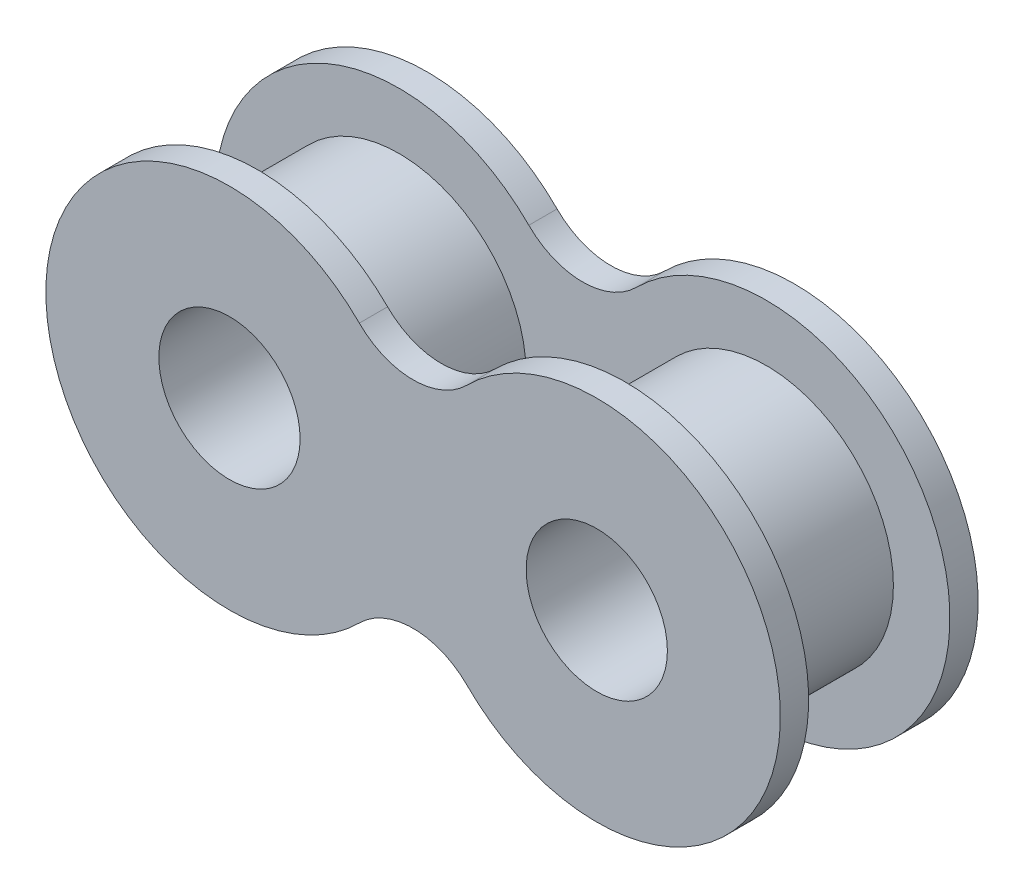
ISO-10303-21;
HEADER;
FILE_DESCRIPTION(('STEP AP214'),'2;1');
FILE_NAME('part.step','',(''),(''),'','','');
FILE_SCHEMA(('AUTOMOTIVE_DESIGN { 1 0 10303 214 1 1 1 1 }'));
ENDSEC;
DATA;
#1=APPLICATION_CONTEXT('core data for automotive mechanical design processes');
#2=APPLICATION_PROTOCOL_DEFINITION('international standard','automotive_design',2000,#1);
#3=PRODUCT_CONTEXT('',#1,'mechanical');
#4=PRODUCT('Part','Part','',(#3));
#5=PRODUCT_RELATED_PRODUCT_CATEGORY('part','',(#4));
#6=PRODUCT_DEFINITION_FORMATION('','',#4);
#7=PRODUCT_DEFINITION_CONTEXT('part definition',#1,'design');
#8=PRODUCT_DEFINITION('design','',#6,#7);
#9=PRODUCT_DEFINITION_SHAPE('','',#8);
#10=(LENGTH_UNIT() NAMED_UNIT(*) SI_UNIT(.MILLI.,.METRE.));
#11=(NAMED_UNIT(*) PLANE_ANGLE_UNIT() SI_UNIT($,.RADIAN.));
#12=(NAMED_UNIT(*) SI_UNIT($,.STERADIAN.) SOLID_ANGLE_UNIT());
#13=UNCERTAINTY_MEASURE_WITH_UNIT(LENGTH_MEASURE(1.E-05),#10,'distance_accuracy_value','');
#14=(GEOMETRIC_REPRESENTATION_CONTEXT(3) GLOBAL_UNCERTAINTY_ASSIGNED_CONTEXT((#13)) GLOBAL_UNIT_ASSIGNED_CONTEXT((#10,
#11,#12)) REPRESENTATION_CONTEXT('',''));
#15=CARTESIAN_POINT('',(0.,0.,0.));
#16=DIRECTION('',(0.,0.,1.));
#17=DIRECTION('',(1.,0.,0.));
#18=AXIS2_PLACEMENT_3D('',#15,#16,#17);
#19=CARTESIAN_POINT('',(3.25,3.25,1.));
#20=DIRECTION('',(0.,0.,1.));
#21=DIRECTION('',(1.,0.,0.));
#22=AXIS2_PLACEMENT_3D('',#19,#20,#21);
#23=PLANE('',#22);
#24=CARTESIAN_POINT('',(6.5,0.,1.));
#25=DIRECTION('',(0.,0.,1.));
#26=DIRECTION('',(1.,0.,0.));
#27=AXIS2_PLACEMENT_3D('',#24,#25,#26);
#28=CIRCLE('',#27,4.5);
#29=CARTESIAN_POINT('',(11.,0.,1.));
#30=VERTEX_POINT('',#29);
#31=EDGE_CURVE('E156',#30,#30,#28,.T.);
#32=ORIENTED_EDGE('',*,*,#31,.F.);
#33=EDGE_LOOP('',(#32));
#34=FACE_BOUND('',#33,.T.);
#35=CARTESIAN_POINT('',(0.,6.5,1.));
#36=DIRECTION('',(0.,0.,-1.));
#37=DIRECTION('',(1.,0.,0.));
#38=AXIS2_PLACEMENT_3D('',#35,#36,#37);
#39=CIRCLE('',#38,2.69238815542512);
#40=CARTESIAN_POINT('',(1.90380592228744,4.59619407771256,1.));
#41=VERTEX_POINT('',#40);
#42=CARTESIAN_POINT('',(-1.90380592228744,4.59619407771256,1.));
#43=VERTEX_POINT('',#42);
#44=EDGE_CURVE('E171',#41,#43,#39,.T.);
#45=ORIENTED_EDGE('',*,*,#44,.T.);
#46=CARTESIAN_POINT('',(-6.5,0.,1.));
#47=DIRECTION('',(0.,0.,1.));
#48=DIRECTION('',(1.,0.,0.));
#49=AXIS2_PLACEMENT_3D('',#46,#47,#48);
#50=CIRCLE('',#49,6.5);
#51=CARTESIAN_POINT('',(-1.90380592228744,-4.59619407771256,1.));
#52=VERTEX_POINT('',#51);
#53=EDGE_CURVE('E81',#43,#52,#50,.T.);
#54=ORIENTED_EDGE('',*,*,#53,.T.);
#55=CARTESIAN_POINT('',(0.,-6.5,1.));
#56=DIRECTION('',(0.,0.,-1.));
#57=DIRECTION('',(1.,0.,0.));
#58=AXIS2_PLACEMENT_3D('',#55,#56,#57);
#59=CIRCLE('',#58,2.69238815542512);
#60=CARTESIAN_POINT('',(1.90380592228744,-4.59619407771256,1.));
#61=VERTEX_POINT('',#60);
#62=EDGE_CURVE('E174',#52,#61,#59,.T.);
#63=ORIENTED_EDGE('',*,*,#62,.T.);
#64=CARTESIAN_POINT('',(6.5,0.,1.));
#65=DIRECTION('',(0.,0.,1.));
#66=DIRECTION('',(1.,0.,0.));
#67=AXIS2_PLACEMENT_3D('',#64,#65,#66);
#68=CIRCLE('',#67,6.5);
#69=EDGE_CURVE('E50',#61,#41,#68,.T.);
#70=ORIENTED_EDGE('',*,*,#69,.T.);
#71=EDGE_LOOP('',(#45,#54,#63,#70));
#72=FACE_BOUND('',#71,.T.);
#73=CARTESIAN_POINT('',(-6.5,0.,1.));
#74=DIRECTION('',(0.,0.,1.));
#75=DIRECTION('',(1.,0.,0.));
#76=AXIS2_PLACEMENT_3D('',#73,#74,#75);
#77=CIRCLE('',#76,4.5);
#78=CARTESIAN_POINT('',(-2.,0.,1.));
#79=VERTEX_POINT('',#78);
#80=EDGE_CURVE('E119',#79,#79,#77,.T.);
#81=ORIENTED_EDGE('',*,*,#80,.F.);
#82=EDGE_LOOP('',(#81));
#83=FACE_BOUND('',#82,.T.);
#84=ADVANCED_FACE('F33',(#34,#72,#83),#23,.T.);
#85=CARTESIAN_POINT('',(3.25,3.25,0.));
#86=DIRECTION('',(0.,0.,1.));
#87=DIRECTION('',(1.,0.,0.));
#88=AXIS2_PLACEMENT_3D('',#85,#86,#87);
#89=PLANE('',#88);
#90=CARTESIAN_POINT('',(0.,6.5,0.));
#91=DIRECTION('',(0.,0.,-1.));
#92=DIRECTION('',(1.,0.,0.));
#93=AXIS2_PLACEMENT_3D('',#90,#91,#92);
#94=CIRCLE('',#93,2.69238815542512);
#95=CARTESIAN_POINT('',(1.90380592228744,4.59619407771256,0.));
#96=VERTEX_POINT('',#95);
#97=CARTESIAN_POINT('',(-1.90380592228744,4.59619407771256,0.));
#98=VERTEX_POINT('',#97);
#99=EDGE_CURVE('E170',#96,#98,#94,.T.);
#100=ORIENTED_EDGE('',*,*,#99,.F.);
#101=CARTESIAN_POINT('',(6.5,0.,0.));
#102=DIRECTION('',(0.,0.,1.));
#103=DIRECTION('',(1.,0.,0.));
#104=AXIS2_PLACEMENT_3D('',#101,#102,#103);
#105=CIRCLE('',#104,6.5);
#106=CARTESIAN_POINT('',(1.90380592228744,-4.59619407771256,0.));
#107=VERTEX_POINT('',#106);
#108=EDGE_CURVE('E74',#107,#96,#105,.T.);
#109=ORIENTED_EDGE('',*,*,#108,.F.);
#110=CARTESIAN_POINT('',(0.,-6.5,0.));
#111=DIRECTION('',(0.,0.,-1.));
#112=DIRECTION('',(1.,0.,0.));
#113=AXIS2_PLACEMENT_3D('',#110,#111,#112);
#114=CIRCLE('',#113,2.69238815542512);
#115=CARTESIAN_POINT('',(-1.90380592228744,-4.59619407771256,0.));
#116=VERTEX_POINT('',#115);
#117=EDGE_CURVE('E68',#116,#107,#114,.T.);
#118=ORIENTED_EDGE('',*,*,#117,.F.);
#119=CARTESIAN_POINT('',(-6.5,0.,0.));
#120=DIRECTION('',(0.,0.,1.));
#121=DIRECTION('',(1.,0.,0.));
#122=AXIS2_PLACEMENT_3D('',#119,#120,#121);
#123=CIRCLE('',#122,6.5);
#124=EDGE_CURVE('E180',#98,#116,#123,.T.);
#125=ORIENTED_EDGE('',*,*,#124,.F.);
#126=EDGE_LOOP('',(#100,#109,#118,#125));
#127=FACE_BOUND('',#126,.T.);
#128=CARTESIAN_POINT('',(-6.5,0.,0.));
#129=DIRECTION('',(0.,0.,1.));
#130=DIRECTION('',(1.,0.,0.));
#131=AXIS2_PLACEMENT_3D('',#128,#129,#130);
#132=CIRCLE('',#131,2.5);
#133=CARTESIAN_POINT('',(-4.,0.,0.));
#134=VERTEX_POINT('',#133);
#135=EDGE_CURVE('E167',#134,#134,#132,.T.);
#136=ORIENTED_EDGE('',*,*,#135,.T.);
#137=EDGE_LOOP('',(#136));
#138=FACE_BOUND('',#137,.T.);
#139=CARTESIAN_POINT('',(6.5,0.,0.));
#140=DIRECTION('',(0.,0.,1.));
#141=DIRECTION('',(1.,0.,0.));
#142=AXIS2_PLACEMENT_3D('',#139,#140,#141);
#143=CIRCLE('',#142,2.5);
#144=CARTESIAN_POINT('',(9.,0.,0.));
#145=VERTEX_POINT('',#144);
#146=EDGE_CURVE('E162',#145,#145,#143,.T.);
#147=ORIENTED_EDGE('',*,*,#146,.T.);
#148=EDGE_LOOP('',(#147));
#149=FACE_BOUND('',#148,.T.);
#150=ADVANCED_FACE('F190',(#127,#138,#149),#89,.F.);
#151=CARTESIAN_POINT('',(0.,6.5,1.));
#152=DIRECTION('',(0.,0.,-1.));
#153=DIRECTION('',(-1.,0.,0.));
#154=AXIS2_PLACEMENT_3D('',#151,#152,#153);
#155=CYLINDRICAL_SURFACE('',#154,2.69238815542512);
#156=ORIENTED_EDGE('',*,*,#99,.T.);
#157=DIRECTION('',(0.,0.,-1.));
#158=VECTOR('',#157,1.);
#159=CARTESIAN_POINT('',(-1.90380592228744,4.59619407771256,1.));
#160=LINE('',#159,#158);
#161=EDGE_CURVE('E11',#43,#98,#160,.T.);
#162=ORIENTED_EDGE('',*,*,#161,.F.);
#163=ORIENTED_EDGE('',*,*,#44,.F.);
#164=DIRECTION('',(0.,0.,-1.));
#165=VECTOR('',#164,1.);
#166=CARTESIAN_POINT('',(1.90380592228744,4.59619407771256,1.));
#167=LINE('',#166,#165);
#168=EDGE_CURVE('E177',#41,#96,#167,.T.);
#169=ORIENTED_EDGE('',*,*,#168,.T.);
#170=EDGE_LOOP('',(#156,#162,#163,#169));
#171=FACE_BOUND('',#170,.T.);
#172=ADVANCED_FACE('F35',(#171),#155,.F.);
#173=CARTESIAN_POINT('',(-6.5,0.,1.));
#174=DIRECTION('',(0.,0.,-1.));
#175=DIRECTION('',(-1.,0.,0.));
#176=AXIS2_PLACEMENT_3D('',#173,#174,#175);
#177=CYLINDRICAL_SURFACE('',#176,6.5);
#178=ORIENTED_EDGE('',*,*,#124,.T.);
#179=DIRECTION('',(0.,0.,-1.));
#180=VECTOR('',#179,1.);
#181=CARTESIAN_POINT('',(-1.90380592228744,-4.59619407771256,1.));
#182=LINE('',#181,#180);
#183=EDGE_CURVE('E42',#52,#116,#182,.T.);
#184=ORIENTED_EDGE('',*,*,#183,.F.);
#185=ORIENTED_EDGE('',*,*,#53,.F.);
#186=ORIENTED_EDGE('',*,*,#161,.T.);
#187=EDGE_LOOP('',(#178,#184,#185,#186));
#188=FACE_BOUND('',#187,.T.);
#189=ADVANCED_FACE('F206',(#188),#177,.T.);
#190=CARTESIAN_POINT('',(0.,-6.5,1.));
#191=DIRECTION('',(0.,0.,-1.));
#192=DIRECTION('',(-1.,0.,0.));
#193=AXIS2_PLACEMENT_3D('',#190,#191,#192);
#194=CYLINDRICAL_SURFACE('',#193,2.69238815542512);
#195=ORIENTED_EDGE('',*,*,#117,.T.);
#196=DIRECTION('',(0.,0.,-1.));
#197=VECTOR('',#196,1.);
#198=CARTESIAN_POINT('',(1.90380592228744,-4.59619407771256,1.));
#199=LINE('',#198,#197);
#200=EDGE_CURVE('E185',#61,#107,#199,.T.);
#201=ORIENTED_EDGE('',*,*,#200,.F.);
#202=ORIENTED_EDGE('',*,*,#62,.F.);
#203=ORIENTED_EDGE('',*,*,#183,.T.);
#204=EDGE_LOOP('',(#195,#201,#202,#203));
#205=FACE_BOUND('',#204,.T.);
#206=ADVANCED_FACE('F187',(#205),#194,.F.);
#207=CARTESIAN_POINT('',(6.5,0.,1.));
#208=DIRECTION('',(0.,0.,-1.));
#209=DIRECTION('',(-1.,0.,0.));
#210=AXIS2_PLACEMENT_3D('',#207,#208,#209);
#211=CYLINDRICAL_SURFACE('',#210,6.5);
#212=ORIENTED_EDGE('',*,*,#108,.T.);
#213=ORIENTED_EDGE('',*,*,#168,.F.);
#214=ORIENTED_EDGE('',*,*,#69,.F.);
#215=ORIENTED_EDGE('',*,*,#200,.T.);
#216=EDGE_LOOP('',(#212,#213,#214,#215));
#217=FACE_BOUND('',#216,.T.);
#218=ADVANCED_FACE('F195',(#217),#211,.T.);
#219=CARTESIAN_POINT('',(-6.5,0.,1.));
#220=DIRECTION('',(0.,0.,-1.));
#221=DIRECTION('',(-1.,0.,0.));
#222=AXIS2_PLACEMENT_3D('',#219,#220,#221);
#223=CYLINDRICAL_SURFACE('',#222,2.5);
#224=ORIENTED_EDGE('',*,*,#135,.F.);
#225=EDGE_LOOP('',(#224));
#226=FACE_BOUND('',#225,.T.);
#227=CARTESIAN_POINT('',(-6.5,0.,7.));
#228=DIRECTION('',(0.,0.,1.));
#229=DIRECTION('',(1.,0.,0.));
#230=AXIS2_PLACEMENT_3D('',#227,#228,#229);
#231=CIRCLE('',#230,2.5);
#232=CARTESIAN_POINT('',(-4.,0.,7.));
#233=VERTEX_POINT('',#232);
#234=EDGE_CURVE('E142',#233,#233,#231,.T.);
#235=ORIENTED_EDGE('',*,*,#234,.T.);
#236=EDGE_LOOP('',(#235));
#237=FACE_BOUND('',#236,.T.);
#238=ADVANCED_FACE('F197',(#226,#237),#223,.F.);
#239=CARTESIAN_POINT('',(6.5,0.,1.));
#240=DIRECTION('',(0.,0.,-1.));
#241=DIRECTION('',(-1.,0.,0.));
#242=AXIS2_PLACEMENT_3D('',#239,#240,#241);
#243=CYLINDRICAL_SURFACE('',#242,2.5);
#244=ORIENTED_EDGE('',*,*,#146,.F.);
#245=EDGE_LOOP('',(#244));
#246=FACE_BOUND('',#245,.T.);
#247=CARTESIAN_POINT('',(6.5,0.,7.));
#248=DIRECTION('',(0.,0.,1.));
#249=DIRECTION('',(1.,0.,0.));
#250=AXIS2_PLACEMENT_3D('',#247,#248,#249);
#251=CIRCLE('',#250,2.5);
#252=CARTESIAN_POINT('',(9.,0.,7.));
#253=VERTEX_POINT('',#252);
#254=EDGE_CURVE('E362',#253,#253,#251,.T.);
#255=ORIENTED_EDGE('',*,*,#254,.T.);
#256=EDGE_LOOP('',(#255));
#257=FACE_BOUND('',#256,.T.);
#258=ADVANCED_FACE('F203',(#246,#257),#243,.F.);
#259=CARTESIAN_POINT('',(6.5,0.,6.));
#260=DIRECTION('',(0.,0.,-1.));
#261=DIRECTION('',(-1.,0.,0.));
#262=AXIS2_PLACEMENT_3D('',#259,#260,#261);
#263=CYLINDRICAL_SURFACE('',#262,4.5);
#264=CARTESIAN_POINT('',(6.5,0.,6.));
#265=DIRECTION('',(0.,0.,1.));
#266=DIRECTION('',(1.,0.,0.));
#267=AXIS2_PLACEMENT_3D('',#264,#265,#266);
#268=CIRCLE('',#267,4.5);
#269=CARTESIAN_POINT('',(11.,0.,6.));
#270=VERTEX_POINT('',#269);
#271=EDGE_CURVE('E159',#270,#270,#268,.T.);
#272=ORIENTED_EDGE('',*,*,#271,.F.);
#273=EDGE_LOOP('',(#272));
#274=FACE_BOUND('',#273,.T.);
#275=ORIENTED_EDGE('',*,*,#31,.T.);
#276=EDGE_LOOP('',(#275));
#277=FACE_BOUND('',#276,.T.);
#278=ADVANCED_FACE('F219',(#274,#277),#263,.T.);
#279=CARTESIAN_POINT('',(-6.5,0.,6.));
#280=DIRECTION('',(0.,0.,-1.));
#281=DIRECTION('',(-1.,0.,0.));
#282=AXIS2_PLACEMENT_3D('',#279,#280,#281);
#283=CYLINDRICAL_SURFACE('',#282,4.5);
#284=CARTESIAN_POINT('',(-6.5,0.,6.));
#285=DIRECTION('',(0.,0.,1.));
#286=DIRECTION('',(1.,0.,0.));
#287=AXIS2_PLACEMENT_3D('',#284,#285,#286);
#288=CIRCLE('',#287,4.5);
#289=CARTESIAN_POINT('',(-2.,0.,6.));
#290=VERTEX_POINT('',#289);
#291=EDGE_CURVE('E153',#290,#290,#288,.T.);
#292=ORIENTED_EDGE('',*,*,#291,.F.);
#293=EDGE_LOOP('',(#292));
#294=FACE_BOUND('',#293,.T.);
#295=ORIENTED_EDGE('',*,*,#80,.T.);
#296=EDGE_LOOP('',(#295));
#297=FACE_BOUND('',#296,.T.);
#298=ADVANCED_FACE('F223',(#294,#297),#283,.T.);
#299=CARTESIAN_POINT('',(0.,6.5,6.));
#300=DIRECTION('',(0.,0.,1.));
#301=DIRECTION('',(1.,0.,0.));
#302=AXIS2_PLACEMENT_3D('',#299,#300,#301);
#303=CYLINDRICAL_SURFACE('',#302,2.69238815542512);
#304=CARTESIAN_POINT('',(0.,6.5,7.));
#305=DIRECTION('',(0.,0.,-1.));
#306=DIRECTION('',(1.,0.,0.));
#307=AXIS2_PLACEMENT_3D('',#304,#305,#306);
#308=CIRCLE('',#307,2.69238815542512);
#309=CARTESIAN_POINT('',(1.90380592228744,4.59619407771256,7.));
#310=VERTEX_POINT('',#309);
#311=CARTESIAN_POINT('',(-1.90380592228744,4.59619407771256,7.));
#312=VERTEX_POINT('',#311);
#313=EDGE_CURVE('E114',#310,#312,#308,.T.);
#314=ORIENTED_EDGE('',*,*,#313,.F.);
#315=DIRECTION('',(0.,0.,1.));
#316=VECTOR('',#315,1.);
#317=CARTESIAN_POINT('',(1.90380592228744,4.59619407771256,6.));
#318=LINE('',#317,#316);
#319=CARTESIAN_POINT('',(1.90380592228744,4.59619407771256,6.));
#320=VERTEX_POINT('',#319);
#321=EDGE_CURVE('E108',#320,#310,#318,.T.);
#322=ORIENTED_EDGE('',*,*,#321,.F.);
#323=CARTESIAN_POINT('',(0.,6.5,6.));
#324=DIRECTION('',(0.,0.,-1.));
#325=DIRECTION('',(1.,0.,0.));
#326=AXIS2_PLACEMENT_3D('',#323,#324,#325);
#327=CIRCLE('',#326,2.69238815542512);
#328=CARTESIAN_POINT('',(-1.90380592228744,4.59619407771256,6.));
#329=VERTEX_POINT('',#328);
#330=EDGE_CURVE('E111',#320,#329,#327,.T.);
#331=ORIENTED_EDGE('',*,*,#330,.T.);
#332=DIRECTION('',(0.,0.,1.));
#333=VECTOR('',#332,1.);
#334=CARTESIAN_POINT('',(-1.90380592228744,4.59619407771256,6.));
#335=LINE('',#334,#333);
#336=EDGE_CURVE('E139',#329,#312,#335,.T.);
#337=ORIENTED_EDGE('',*,*,#336,.T.);
#338=EDGE_LOOP('',(#314,#322,#331,#337));
#339=FACE_BOUND('',#338,.T.);
#340=ADVANCED_FACE('F110',(#339),#303,.F.);
#341=CARTESIAN_POINT('',(6.5,0.,6.));
#342=DIRECTION('',(0.,0.,1.));
#343=DIRECTION('',(1.,0.,0.));
#344=AXIS2_PLACEMENT_3D('',#341,#342,#343);
#345=CYLINDRICAL_SURFACE('',#344,6.5);
#346=CARTESIAN_POINT('',(6.5,0.,7.));
#347=DIRECTION('',(0.,0.,1.));
#348=DIRECTION('',(1.,0.,0.));
#349=AXIS2_PLACEMENT_3D('',#346,#347,#348);
#350=CIRCLE('',#349,6.5);
#351=CARTESIAN_POINT('',(1.90380592228744,-4.59619407771256,7.));
#352=VERTEX_POINT('',#351);
#353=EDGE_CURVE('E141',#352,#310,#350,.T.);
#354=ORIENTED_EDGE('',*,*,#353,.F.);
#355=DIRECTION('',(0.,0.,1.));
#356=VECTOR('',#355,1.);
#357=CARTESIAN_POINT('',(1.90380592228744,-4.59619407771256,6.));
#358=LINE('',#357,#356);
#359=CARTESIAN_POINT('',(1.90380592228744,-4.59619407771256,6.));
#360=VERTEX_POINT('',#359);
#361=EDGE_CURVE('E120',#360,#352,#358,.T.);
#362=ORIENTED_EDGE('',*,*,#361,.F.);
#363=CARTESIAN_POINT('',(6.5,0.,6.));
#364=DIRECTION('',(0.,0.,1.));
#365=DIRECTION('',(1.,0.,0.));
#366=AXIS2_PLACEMENT_3D('',#363,#364,#365);
#367=CIRCLE('',#366,6.5);
#368=EDGE_CURVE('E126',#360,#320,#367,.T.);
#369=ORIENTED_EDGE('',*,*,#368,.T.);
#370=ORIENTED_EDGE('',*,*,#321,.T.);
#371=EDGE_LOOP('',(#354,#362,#369,#370));
#372=FACE_BOUND('',#371,.T.);
#373=ADVANCED_FACE('F132',(#372),#345,.T.);
#374=CARTESIAN_POINT('',(0.,-6.5,6.));
#375=DIRECTION('',(0.,0.,1.));
#376=DIRECTION('',(1.,0.,0.));
#377=AXIS2_PLACEMENT_3D('',#374,#375,#376);
#378=CYLINDRICAL_SURFACE('',#377,2.69238815542512);
#379=CARTESIAN_POINT('',(0.,-6.5,7.));
#380=DIRECTION('',(0.,0.,-1.));
#381=DIRECTION('',(1.,0.,0.));
#382=AXIS2_PLACEMENT_3D('',#379,#380,#381);
#383=CIRCLE('',#382,2.69238815542512);
#384=CARTESIAN_POINT('',(-1.90380592228744,-4.59619407771256,7.));
#385=VERTEX_POINT('',#384);
#386=EDGE_CURVE('E144',#385,#352,#383,.T.);
#387=ORIENTED_EDGE('',*,*,#386,.F.);
#388=DIRECTION('',(0.,0.,1.));
#389=VECTOR('',#388,1.);
#390=CARTESIAN_POINT('',(-1.90380592228744,-4.59619407771256,6.));
#391=LINE('',#390,#389);
#392=CARTESIAN_POINT('',(-1.90380592228744,-4.59619407771256,6.));
#393=VERTEX_POINT('',#392);
#394=EDGE_CURVE('E150',#393,#385,#391,.T.);
#395=ORIENTED_EDGE('',*,*,#394,.F.);
#396=CARTESIAN_POINT('',(0.,-6.5,6.));
#397=DIRECTION('',(0.,0.,-1.));
#398=DIRECTION('',(1.,0.,0.));
#399=AXIS2_PLACEMENT_3D('',#396,#397,#398);
#400=CIRCLE('',#399,2.69238815542512);
#401=EDGE_CURVE('E133',#393,#360,#400,.T.);
#402=ORIENTED_EDGE('',*,*,#401,.T.);
#403=ORIENTED_EDGE('',*,*,#361,.T.);
#404=EDGE_LOOP('',(#387,#395,#402,#403));
#405=FACE_BOUND('',#404,.T.);
#406=ADVANCED_FACE('F232',(#405),#378,.F.);
#407=CARTESIAN_POINT('',(-6.5,0.,6.));
#408=DIRECTION('',(0.,0.,1.));
#409=DIRECTION('',(1.,0.,0.));
#410=AXIS2_PLACEMENT_3D('',#407,#408,#409);
#411=CYLINDRICAL_SURFACE('',#410,6.5);
#412=CARTESIAN_POINT('',(-6.5,0.,7.));
#413=DIRECTION('',(0.,0.,1.));
#414=DIRECTION('',(1.,0.,0.));
#415=AXIS2_PLACEMENT_3D('',#412,#413,#414);
#416=CIRCLE('',#415,6.5);
#417=EDGE_CURVE('E130',#312,#385,#416,.T.);
#418=ORIENTED_EDGE('',*,*,#417,.F.);
#419=ORIENTED_EDGE('',*,*,#336,.F.);
#420=CARTESIAN_POINT('',(-6.5,0.,6.));
#421=DIRECTION('',(0.,0.,1.));
#422=DIRECTION('',(1.,0.,0.));
#423=AXIS2_PLACEMENT_3D('',#420,#421,#422);
#424=CIRCLE('',#423,6.5);
#425=EDGE_CURVE('E129',#329,#393,#424,.T.);
#426=ORIENTED_EDGE('',*,*,#425,.T.);
#427=ORIENTED_EDGE('',*,*,#394,.T.);
#428=EDGE_LOOP('',(#418,#419,#426,#427));
#429=FACE_BOUND('',#428,.T.);
#430=ADVANCED_FACE('F235',(#429),#411,.T.);
#431=CARTESIAN_POINT('',(3.25,3.25,6.));
#432=DIRECTION('',(0.,0.,-1.));
#433=DIRECTION('',(1.,0.,0.));
#434=AXIS2_PLACEMENT_3D('',#431,#432,#433);
#435=PLANE('',#434);
#436=ORIENTED_EDGE('',*,*,#271,.T.);
#437=EDGE_LOOP('',(#436));
#438=FACE_BOUND('',#437,.T.);
#439=ORIENTED_EDGE('',*,*,#291,.T.);
#440=EDGE_LOOP('',(#439));
#441=FACE_BOUND('',#440,.T.);
#442=ORIENTED_EDGE('',*,*,#330,.F.);
#443=ORIENTED_EDGE('',*,*,#368,.F.);
#444=ORIENTED_EDGE('',*,*,#401,.F.);
#445=ORIENTED_EDGE('',*,*,#425,.F.);
#446=EDGE_LOOP('',(#442,#443,#444,#445));
#447=FACE_BOUND('',#446,.T.);
#448=ADVANCED_FACE('F124',(#438,#441,#447),#435,.T.);
#449=CARTESIAN_POINT('',(3.25,3.25,7.));
#450=DIRECTION('',(0.,0.,-1.));
#451=DIRECTION('',(1.,0.,0.));
#452=AXIS2_PLACEMENT_3D('',#449,#450,#451);
#453=PLANE('',#452);
#454=ORIENTED_EDGE('',*,*,#254,.F.);
#455=EDGE_LOOP('',(#454));
#456=FACE_BOUND('',#455,.T.);
#457=ORIENTED_EDGE('',*,*,#234,.F.);
#458=EDGE_LOOP('',(#457));
#459=FACE_BOUND('',#458,.T.);
#460=ORIENTED_EDGE('',*,*,#313,.T.);
#461=ORIENTED_EDGE('',*,*,#417,.T.);
#462=ORIENTED_EDGE('',*,*,#386,.T.);
#463=ORIENTED_EDGE('',*,*,#353,.T.);
#464=EDGE_LOOP('',(#460,#461,#462,#463));
#465=FACE_BOUND('',#464,.T.);
#466=ADVANCED_FACE('F240',(#456,#459,#465),#453,.F.);
#467=CLOSED_SHELL('',(#84,#150,#172,#189,#206,#218,#238,#258,#278,#298,#340,#373,#406,#430,#448,#466));
#468=MANIFOLD_SOLID_BREP('B2',#467);
#469=ADVANCED_BREP_SHAPE_REPRESENTATION('',(#18,#468),#14);
#470=SHAPE_DEFINITION_REPRESENTATION(#9,#469);
ENDSEC;
END-ISO-10303-21;
